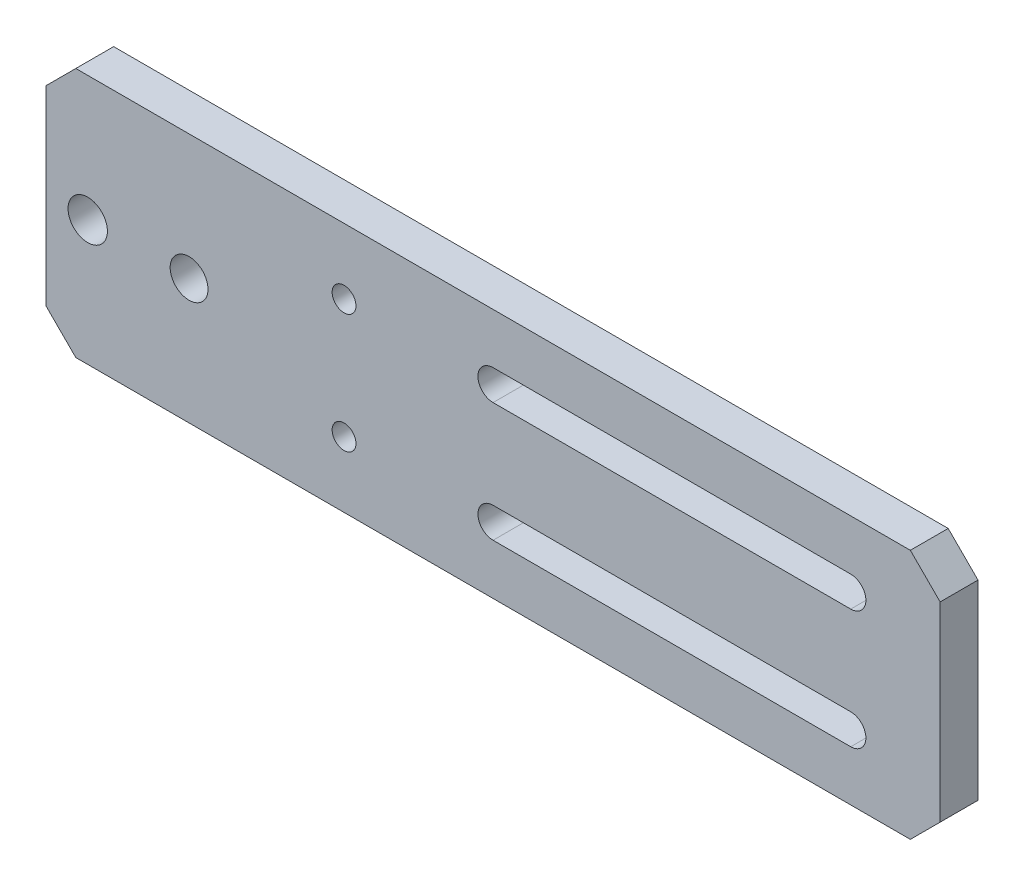
ISO-10303-21;
HEADER;
FILE_DESCRIPTION(('STEP AP214'),'2;1');
FILE_NAME('part.step','',(''),(''),'','','');
FILE_SCHEMA(('AUTOMOTIVE_DESIGN { 1 0 10303 214 1 1 1 1 }'));
ENDSEC;
DATA;
#1=APPLICATION_CONTEXT('core data for automotive mechanical design processes');
#2=APPLICATION_PROTOCOL_DEFINITION('international standard','automotive_design',2000,#1);
#3=PRODUCT_CONTEXT('',#1,'mechanical');
#4=PRODUCT('Part','Part','',(#3));
#5=PRODUCT_RELATED_PRODUCT_CATEGORY('part','',(#4));
#6=PRODUCT_DEFINITION_FORMATION('','',#4);
#7=PRODUCT_DEFINITION_CONTEXT('part definition',#1,'design');
#8=PRODUCT_DEFINITION('design','',#6,#7);
#9=PRODUCT_DEFINITION_SHAPE('','',#8);
#10=(LENGTH_UNIT() NAMED_UNIT(*) SI_UNIT(.MILLI.,.METRE.));
#11=(NAMED_UNIT(*) PLANE_ANGLE_UNIT() SI_UNIT($,.RADIAN.));
#12=(NAMED_UNIT(*) SI_UNIT($,.STERADIAN.) SOLID_ANGLE_UNIT());
#13=UNCERTAINTY_MEASURE_WITH_UNIT(LENGTH_MEASURE(1.E-05),#10,'distance_accuracy_value','');
#14=(GEOMETRIC_REPRESENTATION_CONTEXT(3) GLOBAL_UNCERTAINTY_ASSIGNED_CONTEXT((#13)) GLOBAL_UNIT_ASSIGNED_CONTEXT((#10,
#11,#12)) REPRESENTATION_CONTEXT('',''));
#15=CARTESIAN_POINT('',(0.,0.,0.));
#16=DIRECTION('',(0.,0.,1.));
#17=DIRECTION('',(1.,0.,0.));
#18=AXIS2_PLACEMENT_3D('',#15,#16,#17);
#19=CARTESIAN_POINT('',(0.,0.,6.35));
#20=DIRECTION('',(0.,0.,1.));
#21=DIRECTION('',(1.,0.,0.));
#22=AXIS2_PLACEMENT_3D('',#19,#20,#21);
#23=PLANE('',#22);
#24=DIRECTION('',(0.707106781186547,-0.707106781186548,0.));
#25=VECTOR('',#24,1.);
#26=CARTESIAN_POINT('',(33.,33.,6.35));
#27=LINE('',#26,#25);
#28=CARTESIAN_POINT('',(45.,21.,6.35));
#29=VERTEX_POINT('',#28);
#30=CARTESIAN_POINT('',(50.,16.,6.35));
#31=VERTEX_POINT('',#30);
#32=EDGE_CURVE('E158',#29,#31,#27,.T.);
#33=ORIENTED_EDGE('',*,*,#32,.F.);
#34=DIRECTION('',(-1.,0.,0.));
#35=VECTOR('',#34,1.);
#36=CARTESIAN_POINT('',(-100.,21.,6.35));
#37=LINE('',#36,#35);
#38=CARTESIAN_POINT('',(-95.,21.,6.35));
#39=VERTEX_POINT('',#38);
#40=EDGE_CURVE('E241',#29,#39,#37,.T.);
#41=ORIENTED_EDGE('',*,*,#40,.T.);
#42=DIRECTION('',(0.707106781186549,0.707106781186546,0.));
#43=VECTOR('',#42,1.);
#44=CARTESIAN_POINT('',(-57.9999999999997,58.,6.35));
#45=LINE('',#44,#43);
#46=CARTESIAN_POINT('',(-100.,16.,6.35));
#47=VERTEX_POINT('',#46);
#48=EDGE_CURVE('E269',#39,#47,#45,.F.);
#49=ORIENTED_EDGE('',*,*,#48,.T.);
#50=DIRECTION('',(0.,-1.,0.));
#51=VECTOR('',#50,1.);
#52=CARTESIAN_POINT('',(-100.,21.,6.35));
#53=LINE('',#52,#51);
#54=CARTESIAN_POINT('',(-100.,-16.,6.35));
#55=VERTEX_POINT('',#54);
#56=EDGE_CURVE('E243',#47,#55,#53,.T.);
#57=ORIENTED_EDGE('',*,*,#56,.T.);
#58=DIRECTION('',(-0.707106781186546,0.707106781186549,0.));
#59=VECTOR('',#58,1.);
#60=CARTESIAN_POINT('',(-58.0000000000003,-58.,6.35));
#61=LINE('',#60,#59);
#62=CARTESIAN_POINT('',(-95.,-21.,6.35));
#63=VERTEX_POINT('',#62);
#64=EDGE_CURVE('E267',#55,#63,#61,.F.);
#65=ORIENTED_EDGE('',*,*,#64,.T.);
#66=DIRECTION('',(1.,0.,0.));
#67=VECTOR('',#66,1.);
#68=CARTESIAN_POINT('',(-100.,-21.,6.35));
#69=LINE('',#68,#67);
#70=CARTESIAN_POINT('',(45.,-21.,6.35));
#71=VERTEX_POINT('',#70);
#72=EDGE_CURVE('E173',#63,#71,#69,.T.);
#73=ORIENTED_EDGE('',*,*,#72,.T.);
#74=DIRECTION('',(-0.707106781186547,-0.707106781186548,0.));
#75=VECTOR('',#74,1.);
#76=CARTESIAN_POINT('',(33.,-33.,6.35));
#77=LINE('',#76,#75);
#78=CARTESIAN_POINT('',(50.,-16.,6.35));
#79=VERTEX_POINT('',#78);
#80=EDGE_CURVE('E151',#79,#71,#77,.T.);
#81=ORIENTED_EDGE('',*,*,#80,.F.);
#82=DIRECTION('',(0.,-1.,0.));
#83=VECTOR('',#82,1.);
#84=CARTESIAN_POINT('',(50.,0.,6.35));
#85=LINE('',#84,#83);
#86=EDGE_CURVE('E161',#31,#79,#85,.T.);
#87=ORIENTED_EDGE('',*,*,#86,.F.);
#88=EDGE_LOOP('',(#33,#41,#49,#57,#65,#73,#81,#87));
#89=FACE_BOUND('',#88,.T.);
#90=DIRECTION('',(1.,0.,0.));
#91=VECTOR('',#90,1.);
#92=CARTESIAN_POINT('',(0.,7.46,6.35));
#93=LINE('',#92,#91);
#94=CARTESIAN_POINT('',(-25.,7.46,6.35));
#95=VERTEX_POINT('',#94);
#96=CARTESIAN_POINT('',(35.,7.46,6.35));
#97=VERTEX_POINT('',#96);
#98=EDGE_CURVE('E48',#95,#97,#93,.T.);
#99=ORIENTED_EDGE('',*,*,#98,.F.);
#100=CARTESIAN_POINT('',(-25.,10.,6.35));
#101=DIRECTION('',(0.,0.,1.));
#102=DIRECTION('',(1.,0.,0.));
#103=AXIS2_PLACEMENT_3D('',#100,#101,#102);
#104=CIRCLE('',#103,2.54);
#105=CARTESIAN_POINT('',(-25.,12.54,6.35));
#106=VERTEX_POINT('',#105);
#107=EDGE_CURVE('E190',#106,#95,#104,.T.);
#108=ORIENTED_EDGE('',*,*,#107,.F.);
#109=DIRECTION('',(1.,0.,0.));
#110=VECTOR('',#109,1.);
#111=CARTESIAN_POINT('',(0.,12.54,6.35));
#112=LINE('',#111,#110);
#113=CARTESIAN_POINT('',(35.,12.54,6.35));
#114=VERTEX_POINT('',#113);
#115=EDGE_CURVE('E187',#106,#114,#112,.T.);
#116=ORIENTED_EDGE('',*,*,#115,.T.);
#117=CARTESIAN_POINT('',(35.,10.,6.35));
#118=DIRECTION('',(0.,0.,1.));
#119=DIRECTION('',(1.,0.,0.));
#120=AXIS2_PLACEMENT_3D('',#117,#118,#119);
#121=CIRCLE('',#120,2.54);
#122=EDGE_CURVE('E183',#97,#114,#121,.T.);
#123=ORIENTED_EDGE('',*,*,#122,.F.);
#124=EDGE_LOOP('',(#99,#108,#116,#123));
#125=FACE_BOUND('',#124,.T.);
#126=CARTESIAN_POINT('',(-93.,0.,6.35));
#127=DIRECTION('',(0.,0.,1.));
#128=DIRECTION('',(1.,0.,0.));
#129=AXIS2_PLACEMENT_3D('',#126,#127,#128);
#130=CIRCLE('',#129,3.302);
#131=CARTESIAN_POINT('',(-89.698,0.,6.35));
#132=VERTEX_POINT('',#131);
#133=EDGE_CURVE('E178',#132,#132,#130,.T.);
#134=ORIENTED_EDGE('',*,*,#133,.F.);
#135=EDGE_LOOP('',(#134));
#136=FACE_BOUND('',#135,.T.);
#137=CARTESIAN_POINT('',(-76.,0.,6.35));
#138=DIRECTION('',(0.,0.,1.));
#139=DIRECTION('',(1.,0.,0.));
#140=AXIS2_PLACEMENT_3D('',#137,#138,#139);
#141=CIRCLE('',#140,3.175);
#142=CARTESIAN_POINT('',(-72.825,0.,6.35));
#143=VERTEX_POINT('',#142);
#144=EDGE_CURVE('E220',#143,#143,#141,.T.);
#145=ORIENTED_EDGE('',*,*,#144,.F.);
#146=EDGE_LOOP('',(#145));
#147=FACE_BOUND('',#146,.T.);
#148=CARTESIAN_POINT('',(-50.,10.,6.35));
#149=DIRECTION('',(0.,0.,1.));
#150=DIRECTION('',(1.,0.,0.));
#151=AXIS2_PLACEMENT_3D('',#148,#149,#150);
#152=CIRCLE('',#151,2.);
#153=CARTESIAN_POINT('',(-48.,10.,6.35));
#154=VERTEX_POINT('',#153);
#155=EDGE_CURVE('E233',#154,#154,#152,.T.);
#156=ORIENTED_EDGE('',*,*,#155,.F.);
#157=EDGE_LOOP('',(#156));
#158=FACE_BOUND('',#157,.T.);
#159=CARTESIAN_POINT('',(-50.,-10.,6.35));
#160=DIRECTION('',(0.,0.,1.));
#161=DIRECTION('',(1.,0.,0.));
#162=AXIS2_PLACEMENT_3D('',#159,#160,#161);
#163=CIRCLE('',#162,2.);
#164=CARTESIAN_POINT('',(-48.,-10.,6.35));
#165=VERTEX_POINT('',#164);
#166=EDGE_CURVE('E226',#165,#165,#163,.T.);
#167=ORIENTED_EDGE('',*,*,#166,.F.);
#168=EDGE_LOOP('',(#167));
#169=FACE_BOUND('',#168,.T.);
#170=DIRECTION('',(1.,0.,0.));
#171=VECTOR('',#170,1.);
#172=CARTESIAN_POINT('',(0.,-7.46,6.35));
#173=LINE('',#172,#171);
#174=CARTESIAN_POINT('',(-25.,-7.46,6.35));
#175=VERTEX_POINT('',#174);
#176=CARTESIAN_POINT('',(35.,-7.46,6.35));
#177=VERTEX_POINT('',#176);
#178=EDGE_CURVE('E201',#175,#177,#173,.T.);
#179=ORIENTED_EDGE('',*,*,#178,.T.);
#180=CARTESIAN_POINT('',(35.,-10.,6.35));
#181=DIRECTION('',(0.,0.,1.));
#182=DIRECTION('',(1.,0.,0.));
#183=AXIS2_PLACEMENT_3D('',#180,#181,#182);
#184=CIRCLE('',#183,2.54);
#185=CARTESIAN_POINT('',(35.,-12.54,6.35));
#186=VERTEX_POINT('',#185);
#187=EDGE_CURVE('E56',#177,#186,#184,.F.);
#188=ORIENTED_EDGE('',*,*,#187,.T.);
#189=DIRECTION('',(1.,0.,0.));
#190=VECTOR('',#189,1.);
#191=CARTESIAN_POINT('',(0.,-12.54,6.35));
#192=LINE('',#191,#190);
#193=CARTESIAN_POINT('',(-25.,-12.54,6.35));
#194=VERTEX_POINT('',#193);
#195=EDGE_CURVE('E207',#194,#186,#192,.T.);
#196=ORIENTED_EDGE('',*,*,#195,.F.);
#197=CARTESIAN_POINT('',(-25.,-10.,6.35));
#198=DIRECTION('',(0.,0.,1.));
#199=DIRECTION('',(1.,0.,0.));
#200=AXIS2_PLACEMENT_3D('',#197,#198,#199);
#201=CIRCLE('',#200,2.54);
#202=EDGE_CURVE('E204',#194,#175,#201,.F.);
#203=ORIENTED_EDGE('',*,*,#202,.T.);
#204=EDGE_LOOP('',(#179,#188,#196,#203));
#205=FACE_BOUND('',#204,.T.);
#206=ADVANCED_FACE('F33',(#89,#125,#136,#147,#158,#169,#205),#23,.T.);
#207=CARTESIAN_POINT('',(0.,0.,0.));
#208=DIRECTION('',(0.,0.,1.));
#209=DIRECTION('',(1.,0.,0.));
#210=AXIS2_PLACEMENT_3D('',#207,#208,#209);
#211=PLANE('',#210);
#212=CARTESIAN_POINT('',(-25.,10.,0.));
#213=DIRECTION('',(0.,0.,1.));
#214=DIRECTION('',(1.,0.,0.));
#215=AXIS2_PLACEMENT_3D('',#212,#213,#214);
#216=CIRCLE('',#215,2.54);
#217=CARTESIAN_POINT('',(-25.,12.54,0.));
#218=VERTEX_POINT('',#217);
#219=CARTESIAN_POINT('',(-25.,7.46,0.));
#220=VERTEX_POINT('',#219);
#221=EDGE_CURVE('E290',#218,#220,#216,.T.);
#222=ORIENTED_EDGE('',*,*,#221,.T.);
#223=DIRECTION('',(1.,0.,0.));
#224=VECTOR('',#223,1.);
#225=CARTESIAN_POINT('',(0.,7.46,0.));
#226=LINE('',#225,#224);
#227=CARTESIAN_POINT('',(35.,7.46,0.));
#228=VERTEX_POINT('',#227);
#229=EDGE_CURVE('E293',#220,#228,#226,.T.);
#230=ORIENTED_EDGE('',*,*,#229,.T.);
#231=CARTESIAN_POINT('',(35.,10.,0.));
#232=DIRECTION('',(0.,0.,1.));
#233=DIRECTION('',(1.,0.,0.));
#234=AXIS2_PLACEMENT_3D('',#231,#232,#233);
#235=CIRCLE('',#234,2.54);
#236=CARTESIAN_POINT('',(35.,12.54,0.));
#237=VERTEX_POINT('',#236);
#238=EDGE_CURVE('E284',#228,#237,#235,.T.);
#239=ORIENTED_EDGE('',*,*,#238,.T.);
#240=DIRECTION('',(1.,0.,0.));
#241=VECTOR('',#240,1.);
#242=CARTESIAN_POINT('',(0.,12.54,0.));
#243=LINE('',#242,#241);
#244=EDGE_CURVE('E287',#218,#237,#243,.T.);
#245=ORIENTED_EDGE('',*,*,#244,.F.);
#246=EDGE_LOOP('',(#222,#230,#239,#245));
#247=FACE_BOUND('',#246,.T.);
#248=DIRECTION('',(-1.,0.,0.));
#249=VECTOR('',#248,1.);
#250=CARTESIAN_POINT('',(-100.,21.,0.));
#251=LINE('',#250,#249);
#252=CARTESIAN_POINT('',(45.,21.,0.));
#253=VERTEX_POINT('',#252);
#254=CARTESIAN_POINT('',(-95.,21.,0.));
#255=VERTEX_POINT('',#254);
#256=EDGE_CURVE('E232',#253,#255,#251,.T.);
#257=ORIENTED_EDGE('',*,*,#256,.F.);
#258=DIRECTION('',(0.707106781186547,-0.707106781186548,0.));
#259=VECTOR('',#258,1.);
#260=CARTESIAN_POINT('',(33.,33.,0.));
#261=LINE('',#260,#259);
#262=CARTESIAN_POINT('',(50.,16.,0.));
#263=VERTEX_POINT('',#262);
#264=EDGE_CURVE('E11',#253,#263,#261,.T.);
#265=ORIENTED_EDGE('',*,*,#264,.T.);
#266=DIRECTION('',(0.,-1.,0.));
#267=VECTOR('',#266,1.);
#268=CARTESIAN_POINT('',(50.,0.,0.));
#269=LINE('',#268,#267);
#270=CARTESIAN_POINT('',(50.,-16.,0.));
#271=VERTEX_POINT('',#270);
#272=EDGE_CURVE('E41',#263,#271,#269,.T.);
#273=ORIENTED_EDGE('',*,*,#272,.T.);
#274=DIRECTION('',(-0.707106781186547,-0.707106781186548,0.));
#275=VECTOR('',#274,1.);
#276=CARTESIAN_POINT('',(33.,-33.,0.));
#277=LINE('',#276,#275);
#278=CARTESIAN_POINT('',(45.,-21.,0.));
#279=VERTEX_POINT('',#278);
#280=EDGE_CURVE('E154',#271,#279,#277,.T.);
#281=ORIENTED_EDGE('',*,*,#280,.T.);
#282=DIRECTION('',(1.,0.,0.));
#283=VECTOR('',#282,1.);
#284=CARTESIAN_POINT('',(-100.,-21.,0.));
#285=LINE('',#284,#283);
#286=CARTESIAN_POINT('',(-95.,-21.,0.));
#287=VERTEX_POINT('',#286);
#288=EDGE_CURVE('E244',#287,#279,#285,.T.);
#289=ORIENTED_EDGE('',*,*,#288,.F.);
#290=DIRECTION('',(0.707106781186546,-0.707106781186549,0.));
#291=VECTOR('',#290,1.);
#292=CARTESIAN_POINT('',(-95.,-21.,0.));
#293=LINE('',#292,#291);
#294=CARTESIAN_POINT('',(-100.,-16.,0.));
#295=VERTEX_POINT('',#294);
#296=EDGE_CURVE('E259',#287,#295,#293,.F.);
#297=ORIENTED_EDGE('',*,*,#296,.T.);
#298=DIRECTION('',(0.,-1.,0.));
#299=VECTOR('',#298,1.);
#300=CARTESIAN_POINT('',(-100.,21.,0.));
#301=LINE('',#300,#299);
#302=CARTESIAN_POINT('',(-100.,16.,0.));
#303=VERTEX_POINT('',#302);
#304=EDGE_CURVE('E250',#303,#295,#301,.T.);
#305=ORIENTED_EDGE('',*,*,#304,.F.);
#306=DIRECTION('',(-0.707106781186549,-0.707106781186546,0.));
#307=VECTOR('',#306,1.);
#308=CARTESIAN_POINT('',(-100.,16.,0.));
#309=LINE('',#308,#307);
#310=EDGE_CURVE('E261',#303,#255,#309,.F.);
#311=ORIENTED_EDGE('',*,*,#310,.T.);
#312=EDGE_LOOP('',(#257,#265,#273,#281,#289,#297,#305,#311));
#313=FACE_BOUND('',#312,.T.);
#314=CARTESIAN_POINT('',(-50.,-10.,0.));
#315=DIRECTION('',(0.,0.,1.));
#316=DIRECTION('',(1.,0.,0.));
#317=AXIS2_PLACEMENT_3D('',#314,#315,#316);
#318=CIRCLE('',#317,2.);
#319=CARTESIAN_POINT('',(-48.,-10.,0.));
#320=VERTEX_POINT('',#319);
#321=EDGE_CURVE('E236',#320,#320,#318,.T.);
#322=ORIENTED_EDGE('',*,*,#321,.T.);
#323=EDGE_LOOP('',(#322));
#324=FACE_BOUND('',#323,.T.);
#325=CARTESIAN_POINT('',(-50.,10.,0.));
#326=DIRECTION('',(0.,0.,1.));
#327=DIRECTION('',(1.,0.,0.));
#328=AXIS2_PLACEMENT_3D('',#325,#326,#327);
#329=CIRCLE('',#328,2.);
#330=CARTESIAN_POINT('',(-48.,10.,0.));
#331=VERTEX_POINT('',#330);
#332=EDGE_CURVE('E229',#331,#331,#329,.T.);
#333=ORIENTED_EDGE('',*,*,#332,.T.);
#334=EDGE_LOOP('',(#333));
#335=FACE_BOUND('',#334,.T.);
#336=CARTESIAN_POINT('',(-76.,0.,0.));
#337=DIRECTION('',(0.,0.,1.));
#338=DIRECTION('',(1.,0.,0.));
#339=AXIS2_PLACEMENT_3D('',#336,#337,#338);
#340=CIRCLE('',#339,3.175);
#341=CARTESIAN_POINT('',(-72.825,0.,0.));
#342=VERTEX_POINT('',#341);
#343=EDGE_CURVE('E223',#342,#342,#340,.T.);
#344=ORIENTED_EDGE('',*,*,#343,.T.);
#345=EDGE_LOOP('',(#344));
#346=FACE_BOUND('',#345,.T.);
#347=CARTESIAN_POINT('',(-93.,0.,0.));
#348=DIRECTION('',(0.,0.,1.));
#349=DIRECTION('',(1.,0.,0.));
#350=AXIS2_PLACEMENT_3D('',#347,#348,#349);
#351=CIRCLE('',#350,3.302);
#352=CARTESIAN_POINT('',(-89.698,0.,0.));
#353=VERTEX_POINT('',#352);
#354=EDGE_CURVE('E217',#353,#353,#351,.T.);
#355=ORIENTED_EDGE('',*,*,#354,.T.);
#356=EDGE_LOOP('',(#355));
#357=FACE_BOUND('',#356,.T.);
#358=CARTESIAN_POINT('',(35.,-10.,0.));
#359=DIRECTION('',(0.,0.,1.));
#360=DIRECTION('',(1.,0.,0.));
#361=AXIS2_PLACEMENT_3D('',#358,#359,#360);
#362=CIRCLE('',#361,2.54);
#363=CARTESIAN_POINT('',(35.,-7.46,0.));
#364=VERTEX_POINT('',#363);
#365=CARTESIAN_POINT('',(35.,-12.54,0.));
#366=VERTEX_POINT('',#365);
#367=EDGE_CURVE('E282',#364,#366,#362,.F.);
#368=ORIENTED_EDGE('',*,*,#367,.F.);
#369=DIRECTION('',(1.,0.,0.));
#370=VECTOR('',#369,1.);
#371=CARTESIAN_POINT('',(0.,-7.46,0.));
#372=LINE('',#371,#370);
#373=CARTESIAN_POINT('',(-25.,-7.46,0.));
#374=VERTEX_POINT('',#373);
#375=EDGE_CURVE('E274',#374,#364,#372,.T.);
#376=ORIENTED_EDGE('',*,*,#375,.F.);
#377=CARTESIAN_POINT('',(-25.,-10.,0.));
#378=DIRECTION('',(0.,0.,1.));
#379=DIRECTION('',(1.,0.,0.));
#380=AXIS2_PLACEMENT_3D('',#377,#378,#379);
#381=CIRCLE('',#380,2.54);
#382=CARTESIAN_POINT('',(-25.,-12.54,0.));
#383=VERTEX_POINT('',#382);
#384=EDGE_CURVE('E276',#383,#374,#381,.F.);
#385=ORIENTED_EDGE('',*,*,#384,.F.);
#386=DIRECTION('',(1.,0.,0.));
#387=VECTOR('',#386,1.);
#388=CARTESIAN_POINT('',(0.,-12.54,0.));
#389=LINE('',#388,#387);
#390=EDGE_CURVE('E279',#383,#366,#389,.T.);
#391=ORIENTED_EDGE('',*,*,#390,.T.);
#392=EDGE_LOOP('',(#368,#376,#385,#391));
#393=FACE_BOUND('',#392,.T.);
#394=ADVANCED_FACE('F298',(#247,#313,#324,#335,#346,#357,#393),#211,.F.);
#395=CARTESIAN_POINT('',(-100.,21.,6.35));
#396=DIRECTION('',(0.,-1.,0.));
#397=DIRECTION('',(0.,0.,-1.));
#398=AXIS2_PLACEMENT_3D('',#395,#396,#397);
#399=PLANE('',#398);
#400=ORIENTED_EDGE('',*,*,#40,.F.);
#401=DIRECTION('',(0.,0.,1.));
#402=VECTOR('',#401,1.);
#403=CARTESIAN_POINT('',(45.,21.,-3.65));
#404=LINE('',#403,#402);
#405=EDGE_CURVE('E179',#253,#29,#404,.T.);
#406=ORIENTED_EDGE('',*,*,#405,.F.);
#407=ORIENTED_EDGE('',*,*,#256,.T.);
#408=DIRECTION('',(0.,0.,1.));
#409=VECTOR('',#408,1.);
#410=CARTESIAN_POINT('',(-95.,21.,6.35));
#411=LINE('',#410,#409);
#412=EDGE_CURVE('E264',#255,#39,#411,.T.);
#413=ORIENTED_EDGE('',*,*,#412,.T.);
#414=EDGE_LOOP('',(#400,#406,#407,#413));
#415=FACE_BOUND('',#414,.T.);
#416=ADVANCED_FACE('F306',(#415),#399,.F.);
#417=CARTESIAN_POINT('',(-100.,21.,6.35));
#418=DIRECTION('',(1.,0.,0.));
#419=DIRECTION('',(0.,0.,-1.));
#420=AXIS2_PLACEMENT_3D('',#417,#418,#419);
#421=PLANE('',#420);
#422=ORIENTED_EDGE('',*,*,#56,.F.);
#423=DIRECTION('',(0.,0.,-1.));
#424=VECTOR('',#423,1.);
#425=CARTESIAN_POINT('',(-100.,16.,6.35));
#426=LINE('',#425,#424);
#427=EDGE_CURVE('E256',#47,#303,#426,.T.);
#428=ORIENTED_EDGE('',*,*,#427,.T.);
#429=ORIENTED_EDGE('',*,*,#304,.T.);
#430=DIRECTION('',(0.,0.,1.));
#431=VECTOR('',#430,1.);
#432=CARTESIAN_POINT('',(-100.,-16.,6.35));
#433=LINE('',#432,#431);
#434=EDGE_CURVE('E248',#295,#55,#433,.T.);
#435=ORIENTED_EDGE('',*,*,#434,.T.);
#436=EDGE_LOOP('',(#422,#428,#429,#435));
#437=FACE_BOUND('',#436,.T.);
#438=ADVANCED_FACE('F315',(#437),#421,.F.);
#439=CARTESIAN_POINT('',(-100.,-21.,6.35));
#440=DIRECTION('',(0.,1.,0.));
#441=DIRECTION('',(0.,0.,1.));
#442=AXIS2_PLACEMENT_3D('',#439,#440,#441);
#443=PLANE('',#442);
#444=ORIENTED_EDGE('',*,*,#288,.T.);
#445=DIRECTION('',(0.,0.,1.));
#446=VECTOR('',#445,1.);
#447=CARTESIAN_POINT('',(45.,-21.,-3.65));
#448=LINE('',#447,#446);
#449=EDGE_CURVE('E157',#279,#71,#448,.T.);
#450=ORIENTED_EDGE('',*,*,#449,.T.);
#451=ORIENTED_EDGE('',*,*,#72,.F.);
#452=DIRECTION('',(0.,0.,-1.));
#453=VECTOR('',#452,1.);
#454=CARTESIAN_POINT('',(-95.,-21.,6.35));
#455=LINE('',#454,#453);
#456=EDGE_CURVE('E271',#63,#287,#455,.T.);
#457=ORIENTED_EDGE('',*,*,#456,.T.);
#458=EDGE_LOOP('',(#444,#450,#451,#457));
#459=FACE_BOUND('',#458,.T.);
#460=ADVANCED_FACE('F321',(#459),#443,.F.);
#461=CARTESIAN_POINT('',(-50.,-10.,0.));
#462=DIRECTION('',(0.,0.,1.));
#463=DIRECTION('',(1.,0.,0.));
#464=AXIS2_PLACEMENT_3D('',#461,#462,#463);
#465=CYLINDRICAL_SURFACE('',#464,2.);
#466=ORIENTED_EDGE('',*,*,#321,.F.);
#467=EDGE_LOOP('',(#466));
#468=FACE_BOUND('',#467,.T.);
#469=ORIENTED_EDGE('',*,*,#166,.T.);
#470=EDGE_LOOP('',(#469));
#471=FACE_BOUND('',#470,.T.);
#472=ADVANCED_FACE('F323',(#468,#471),#465,.F.);
#473=CARTESIAN_POINT('',(-50.,10.,0.));
#474=DIRECTION('',(0.,0.,1.));
#475=DIRECTION('',(1.,0.,0.));
#476=AXIS2_PLACEMENT_3D('',#473,#474,#475);
#477=CYLINDRICAL_SURFACE('',#476,2.);
#478=ORIENTED_EDGE('',*,*,#332,.F.);
#479=EDGE_LOOP('',(#478));
#480=FACE_BOUND('',#479,.T.);
#481=ORIENTED_EDGE('',*,*,#155,.T.);
#482=EDGE_LOOP('',(#481));
#483=FACE_BOUND('',#482,.T.);
#484=ADVANCED_FACE('F330',(#480,#483),#477,.F.);
#485=CARTESIAN_POINT('',(-76.,0.,0.));
#486=DIRECTION('',(0.,0.,1.));
#487=DIRECTION('',(1.,0.,0.));
#488=AXIS2_PLACEMENT_3D('',#485,#486,#487);
#489=CYLINDRICAL_SURFACE('',#488,3.175);
#490=ORIENTED_EDGE('',*,*,#343,.F.);
#491=EDGE_LOOP('',(#490));
#492=FACE_BOUND('',#491,.T.);
#493=ORIENTED_EDGE('',*,*,#144,.T.);
#494=EDGE_LOOP('',(#493));
#495=FACE_BOUND('',#494,.T.);
#496=ADVANCED_FACE('F346',(#492,#495),#489,.F.);
#497=CARTESIAN_POINT('',(-100.,16.,6.35));
#498=DIRECTION('',(0.707106781186546,-0.707106781186549,0.));
#499=DIRECTION('',(0.,0.,-1.));
#500=AXIS2_PLACEMENT_3D('',#497,#498,#499);
#501=PLANE('',#500);
#502=ORIENTED_EDGE('',*,*,#48,.F.);
#503=ORIENTED_EDGE('',*,*,#412,.F.);
#504=ORIENTED_EDGE('',*,*,#310,.F.);
#505=ORIENTED_EDGE('',*,*,#427,.F.);
#506=EDGE_LOOP('',(#502,#503,#504,#505));
#507=FACE_BOUND('',#506,.T.);
#508=ADVANCED_FACE('F311',(#507),#501,.F.);
#509=CARTESIAN_POINT('',(-95.,-21.,6.35));
#510=DIRECTION('',(0.707106781186549,0.707106781186545,0.));
#511=DIRECTION('',(0.,0.,-1.));
#512=AXIS2_PLACEMENT_3D('',#509,#510,#511);
#513=PLANE('',#512);
#514=ORIENTED_EDGE('',*,*,#64,.F.);
#515=ORIENTED_EDGE('',*,*,#434,.F.);
#516=ORIENTED_EDGE('',*,*,#296,.F.);
#517=ORIENTED_EDGE('',*,*,#456,.F.);
#518=EDGE_LOOP('',(#514,#515,#516,#517));
#519=FACE_BOUND('',#518,.T.);
#520=ADVANCED_FACE('F35',(#519),#513,.F.);
#521=CARTESIAN_POINT('',(-93.,0.,0.));
#522=DIRECTION('',(0.,0.,1.));
#523=DIRECTION('',(1.,0.,0.));
#524=AXIS2_PLACEMENT_3D('',#521,#522,#523);
#525=CYLINDRICAL_SURFACE('',#524,3.302);
#526=ORIENTED_EDGE('',*,*,#354,.F.);
#527=EDGE_LOOP('',(#526));
#528=FACE_BOUND('',#527,.T.);
#529=ORIENTED_EDGE('',*,*,#133,.T.);
#530=EDGE_LOOP('',(#529));
#531=FACE_BOUND('',#530,.T.);
#532=ADVANCED_FACE('F351',(#528,#531),#525,.F.);
#533=CARTESIAN_POINT('',(35.,-10.,-3.65));
#534=DIRECTION('',(0.,0.,1.));
#535=DIRECTION('',(1.,0.,0.));
#536=AXIS2_PLACEMENT_3D('',#533,#534,#535);
#537=CYLINDRICAL_SURFACE('',#536,2.54);
#538=ORIENTED_EDGE('',*,*,#367,.T.);
#539=DIRECTION('',(0.,0.,1.));
#540=VECTOR('',#539,1.);
#541=CARTESIAN_POINT('',(35.,-12.54,-3.65));
#542=LINE('',#541,#540);
#543=EDGE_CURVE('E184',#366,#186,#542,.T.);
#544=ORIENTED_EDGE('',*,*,#543,.T.);
#545=ORIENTED_EDGE('',*,*,#187,.F.);
#546=DIRECTION('',(0.,0.,1.));
#547=VECTOR('',#546,1.);
#548=CARTESIAN_POINT('',(35.,-7.46,-3.65));
#549=LINE('',#548,#547);
#550=EDGE_CURVE('E210',#364,#177,#549,.T.);
#551=ORIENTED_EDGE('',*,*,#550,.F.);
#552=EDGE_LOOP('',(#538,#544,#545,#551));
#553=FACE_BOUND('',#552,.T.);
#554=ADVANCED_FACE('F354',(#553),#537,.F.);
#555=CARTESIAN_POINT('',(0.,-12.54,-3.65));
#556=DIRECTION('',(0.,-1.,0.));
#557=DIRECTION('',(1.,0.,0.));
#558=AXIS2_PLACEMENT_3D('',#555,#556,#557);
#559=PLANE('',#558);
#560=DIRECTION('',(0.,0.,1.));
#561=VECTOR('',#560,1.);
#562=CARTESIAN_POINT('',(-25.,-12.54,-3.65));
#563=LINE('',#562,#561);
#564=EDGE_CURVE('E212',#383,#194,#563,.T.);
#565=ORIENTED_EDGE('',*,*,#564,.T.);
#566=ORIENTED_EDGE('',*,*,#195,.T.);
#567=ORIENTED_EDGE('',*,*,#543,.F.);
#568=ORIENTED_EDGE('',*,*,#390,.F.);
#569=EDGE_LOOP('',(#565,#566,#567,#568));
#570=FACE_BOUND('',#569,.T.);
#571=ADVANCED_FACE('F358',(#570),#559,.F.);
#572=CARTESIAN_POINT('',(-25.,-10.,-3.65));
#573=DIRECTION('',(0.,0.,1.));
#574=DIRECTION('',(1.,0.,0.));
#575=AXIS2_PLACEMENT_3D('',#572,#573,#574);
#576=CYLINDRICAL_SURFACE('',#575,2.54);
#577=ORIENTED_EDGE('',*,*,#384,.T.);
#578=DIRECTION('',(0.,0.,1.));
#579=VECTOR('',#578,1.);
#580=CARTESIAN_POINT('',(-25.,-7.46,-3.65));
#581=LINE('',#580,#579);
#582=EDGE_CURVE('E214',#374,#175,#581,.T.);
#583=ORIENTED_EDGE('',*,*,#582,.T.);
#584=ORIENTED_EDGE('',*,*,#202,.F.);
#585=ORIENTED_EDGE('',*,*,#564,.F.);
#586=EDGE_LOOP('',(#577,#583,#584,#585));
#587=FACE_BOUND('',#586,.T.);
#588=ADVANCED_FACE('F363',(#587),#576,.F.);
#589=CARTESIAN_POINT('',(0.,-7.46,-3.65));
#590=DIRECTION('',(0.,-1.,0.));
#591=DIRECTION('',(1.,0.,0.));
#592=AXIS2_PLACEMENT_3D('',#589,#590,#591);
#593=PLANE('',#592);
#594=ORIENTED_EDGE('',*,*,#375,.T.);
#595=ORIENTED_EDGE('',*,*,#550,.T.);
#596=ORIENTED_EDGE('',*,*,#178,.F.);
#597=ORIENTED_EDGE('',*,*,#582,.F.);
#598=EDGE_LOOP('',(#594,#595,#596,#597));
#599=FACE_BOUND('',#598,.T.);
#600=ADVANCED_FACE('F359',(#599),#593,.T.);
#601=CARTESIAN_POINT('',(0.,7.46,-3.65));
#602=DIRECTION('',(0.,-1.,0.));
#603=DIRECTION('',(1.,0.,0.));
#604=AXIS2_PLACEMENT_3D('',#601,#602,#603);
#605=PLANE('',#604);
#606=DIRECTION('',(0.,0.,1.));
#607=VECTOR('',#606,1.);
#608=CARTESIAN_POINT('',(-25.,7.46,-3.65));
#609=LINE('',#608,#607);
#610=EDGE_CURVE('E168',#220,#95,#609,.T.);
#611=ORIENTED_EDGE('',*,*,#610,.T.);
#612=ORIENTED_EDGE('',*,*,#98,.T.);
#613=DIRECTION('',(0.,0.,1.));
#614=VECTOR('',#613,1.);
#615=CARTESIAN_POINT('',(35.,7.46,-3.65));
#616=LINE('',#615,#614);
#617=EDGE_CURVE('E193',#228,#97,#616,.T.);
#618=ORIENTED_EDGE('',*,*,#617,.F.);
#619=ORIENTED_EDGE('',*,*,#229,.F.);
#620=EDGE_LOOP('',(#611,#612,#618,#619));
#621=FACE_BOUND('',#620,.T.);
#622=ADVANCED_FACE('F362',(#621),#605,.F.);
#623=CARTESIAN_POINT('',(-25.,10.,-3.65));
#624=DIRECTION('',(0.,0.,1.));
#625=DIRECTION('',(1.,0.,0.));
#626=AXIS2_PLACEMENT_3D('',#623,#624,#625);
#627=CYLINDRICAL_SURFACE('',#626,2.54);
#628=DIRECTION('',(0.,0.,1.));
#629=VECTOR('',#628,1.);
#630=CARTESIAN_POINT('',(-25.,12.54,-3.65));
#631=LINE('',#630,#629);
#632=EDGE_CURVE('E195',#218,#106,#631,.T.);
#633=ORIENTED_EDGE('',*,*,#632,.T.);
#634=ORIENTED_EDGE('',*,*,#107,.T.);
#635=ORIENTED_EDGE('',*,*,#610,.F.);
#636=ORIENTED_EDGE('',*,*,#221,.F.);
#637=EDGE_LOOP('',(#633,#634,#635,#636));
#638=FACE_BOUND('',#637,.T.);
#639=ADVANCED_FACE('F373',(#638),#627,.F.);
#640=CARTESIAN_POINT('',(0.,12.54,-3.65));
#641=DIRECTION('',(0.,-1.,0.));
#642=DIRECTION('',(1.,0.,0.));
#643=AXIS2_PLACEMENT_3D('',#640,#641,#642);
#644=PLANE('',#643);
#645=ORIENTED_EDGE('',*,*,#244,.T.);
#646=DIRECTION('',(0.,0.,1.));
#647=VECTOR('',#646,1.);
#648=CARTESIAN_POINT('',(35.,12.54,-3.65));
#649=LINE('',#648,#647);
#650=EDGE_CURVE('E197',#237,#114,#649,.T.);
#651=ORIENTED_EDGE('',*,*,#650,.T.);
#652=ORIENTED_EDGE('',*,*,#115,.F.);
#653=ORIENTED_EDGE('',*,*,#632,.F.);
#654=EDGE_LOOP('',(#645,#651,#652,#653));
#655=FACE_BOUND('',#654,.T.);
#656=ADVANCED_FACE('F377',(#655),#644,.T.);
#657=CARTESIAN_POINT('',(35.,10.,-3.65));
#658=DIRECTION('',(0.,0.,1.));
#659=DIRECTION('',(1.,0.,0.));
#660=AXIS2_PLACEMENT_3D('',#657,#658,#659);
#661=CYLINDRICAL_SURFACE('',#660,2.54);
#662=ORIENTED_EDGE('',*,*,#617,.T.);
#663=ORIENTED_EDGE('',*,*,#122,.T.);
#664=ORIENTED_EDGE('',*,*,#650,.F.);
#665=ORIENTED_EDGE('',*,*,#238,.F.);
#666=EDGE_LOOP('',(#662,#663,#664,#665));
#667=FACE_BOUND('',#666,.T.);
#668=ADVANCED_FACE('F374',(#667),#661,.F.);
#669=CARTESIAN_POINT('',(50.,0.,-3.65));
#670=DIRECTION('',(-1.,0.,0.));
#671=DIRECTION('',(0.,0.,1.));
#672=AXIS2_PLACEMENT_3D('',#669,#670,#671);
#673=PLANE('',#672);
#674=DIRECTION('',(0.,0.,1.));
#675=VECTOR('',#674,1.);
#676=CARTESIAN_POINT('',(50.,16.,-3.65));
#677=LINE('',#676,#675);
#678=EDGE_CURVE('E164',#263,#31,#677,.T.);
#679=ORIENTED_EDGE('',*,*,#678,.T.);
#680=ORIENTED_EDGE('',*,*,#86,.T.);
#681=DIRECTION('',(0.,0.,1.));
#682=VECTOR('',#681,1.);
#683=CARTESIAN_POINT('',(50.,-16.,-3.65));
#684=LINE('',#683,#682);
#685=EDGE_CURVE('E147',#271,#79,#684,.T.);
#686=ORIENTED_EDGE('',*,*,#685,.F.);
#687=ORIENTED_EDGE('',*,*,#272,.F.);
#688=EDGE_LOOP('',(#679,#680,#686,#687));
#689=FACE_BOUND('',#688,.T.);
#690=ADVANCED_FACE('F162',(#689),#673,.F.);
#691=CARTESIAN_POINT('',(33.,33.,-3.65));
#692=DIRECTION('',(-0.707106781186548,-0.707106781186547,0.));
#693=DIRECTION('',(0.707106781186547,-0.707106781186548,0.));
#694=AXIS2_PLACEMENT_3D('',#691,#692,#693);
#695=PLANE('',#694);
#696=ORIENTED_EDGE('',*,*,#405,.T.);
#697=ORIENTED_EDGE('',*,*,#32,.T.);
#698=ORIENTED_EDGE('',*,*,#678,.F.);
#699=ORIENTED_EDGE('',*,*,#264,.F.);
#700=EDGE_LOOP('',(#696,#697,#698,#699));
#701=FACE_BOUND('',#700,.T.);
#702=ADVANCED_FACE('F302',(#701),#695,.F.);
#703=CARTESIAN_POINT('',(33.,-33.,-3.65));
#704=DIRECTION('',(-0.707106781186548,0.707106781186547,0.));
#705=DIRECTION('',(-0.707106781186547,-0.707106781186548,0.));
#706=AXIS2_PLACEMENT_3D('',#703,#704,#705);
#707=PLANE('',#706);
#708=ORIENTED_EDGE('',*,*,#685,.T.);
#709=ORIENTED_EDGE('',*,*,#80,.T.);
#710=ORIENTED_EDGE('',*,*,#449,.F.);
#711=ORIENTED_EDGE('',*,*,#280,.F.);
#712=EDGE_LOOP('',(#708,#709,#710,#711));
#713=FACE_BOUND('',#712,.T.);
#714=ADVANCED_FACE('F149',(#713),#707,.F.);
#715=CLOSED_SHELL('',(#206,#394,#416,#438,#460,#472,#484,#496,#508,#520,#532,#554,#571,#588,
#600,#622,#639,#656,#668,#690,#702,#714));
#716=MANIFOLD_SOLID_BREP('B2',#715);
#717=ADVANCED_BREP_SHAPE_REPRESENTATION('',(#18,#716),#14);
#718=SHAPE_DEFINITION_REPRESENTATION(#9,#717);
ENDSEC;
END-ISO-10303-21;
